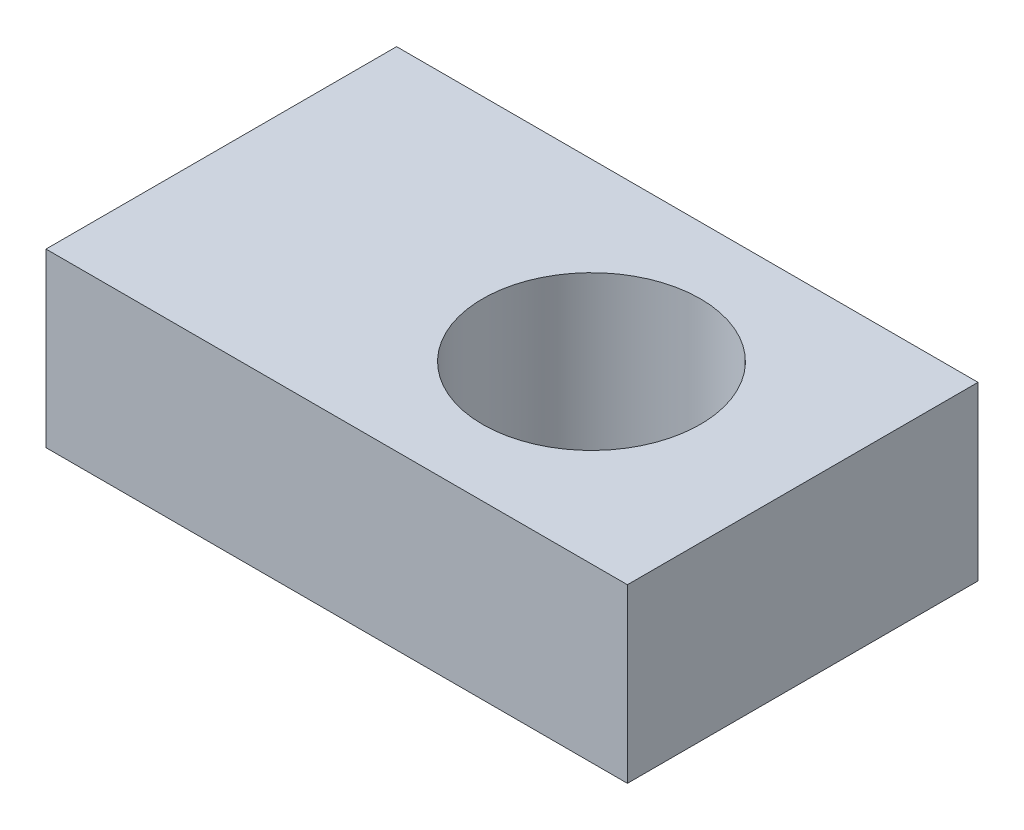
ISO-10303-21;
HEADER;
FILE_DESCRIPTION(('STEP AP214'),'2;1');
FILE_NAME('part.step','',(''),(''),'','','');
FILE_SCHEMA(('AUTOMOTIVE_DESIGN { 1 0 10303 214 1 1 1 1 }'));
ENDSEC;
DATA;
#1=APPLICATION_CONTEXT('core data for automotive mechanical design processes');
#2=APPLICATION_PROTOCOL_DEFINITION('international standard','automotive_design',2000,#1);
#3=PRODUCT_CONTEXT('',#1,'mechanical');
#4=PRODUCT('Part','Part','',(#3));
#5=PRODUCT_RELATED_PRODUCT_CATEGORY('part','',(#4));
#6=PRODUCT_DEFINITION_FORMATION('','',#4);
#7=PRODUCT_DEFINITION_CONTEXT('part definition',#1,'design');
#8=PRODUCT_DEFINITION('design','',#6,#7);
#9=PRODUCT_DEFINITION_SHAPE('','',#8);
#10=(LENGTH_UNIT() NAMED_UNIT(*) SI_UNIT(.MILLI.,.METRE.));
#11=(NAMED_UNIT(*) PLANE_ANGLE_UNIT() SI_UNIT($,.RADIAN.));
#12=(NAMED_UNIT(*) SI_UNIT($,.STERADIAN.) SOLID_ANGLE_UNIT());
#13=UNCERTAINTY_MEASURE_WITH_UNIT(LENGTH_MEASURE(1.E-05),#10,'distance_accuracy_value','');
#14=(GEOMETRIC_REPRESENTATION_CONTEXT(3) GLOBAL_UNCERTAINTY_ASSIGNED_CONTEXT((#13)) GLOBAL_UNIT_ASSIGNED_CONTEXT((#10,
#11,#12)) REPRESENTATION_CONTEXT('',''));
#15=CARTESIAN_POINT('',(0.,0.,0.));
#16=DIRECTION('',(0.,0.,1.));
#17=DIRECTION('',(1.,0.,0.));
#18=AXIS2_PLACEMENT_3D('',#15,#16,#17);
#19=CARTESIAN_POINT('',(2.77,-0.06,4.96));
#20=DIRECTION('',(0.,-1.,0.));
#21=DIRECTION('',(0.,0.,-1.));
#22=AXIS2_PLACEMENT_3D('',#19,#20,#21);
#23=PLANE('',#22);
#24=CARTESIAN_POINT('',(3.5,-0.0599999999999999,4.96));
#25=DIRECTION('',(0.,-1.,0.));
#26=DIRECTION('',(0.,0.,-1.));
#27=AXIS2_PLACEMENT_3D('',#24,#25,#26);
#28=CIRCLE('',#27,1.);
#29=CARTESIAN_POINT('',(3.5,-0.0599999999999999,3.96));
#30=VERTEX_POINT('',#29);
#31=EDGE_CURVE('E20',#30,#30,#28,.F.);
#32=ORIENTED_EDGE('',*,*,#31,.T.);
#33=EDGE_LOOP('',(#32));
#34=FACE_BOUND('',#33,.T.);
#35=DIRECTION('',(-1.,0.,0.));
#36=VECTOR('',#35,1.);
#37=CARTESIAN_POINT('',(0.1,-0.0599999999999999,3.35));
#38=LINE('',#37,#36);
#39=CARTESIAN_POINT('',(5.44,-0.06,3.35));
#40=VERTEX_POINT('',#39);
#41=CARTESIAN_POINT('',(0.1,-0.06,3.35));
#42=VERTEX_POINT('',#41);
#43=EDGE_CURVE('E69',#40,#42,#38,.T.);
#44=ORIENTED_EDGE('',*,*,#43,.F.);
#45=DIRECTION('',(0.,0.,-1.));
#46=VECTOR('',#45,1.);
#47=CARTESIAN_POINT('',(5.44,-0.0599999999999999,3.35));
#48=LINE('',#47,#46);
#49=CARTESIAN_POINT('',(5.44,-0.06,6.57));
#50=VERTEX_POINT('',#49);
#51=EDGE_CURVE('E54',#50,#40,#48,.T.);
#52=ORIENTED_EDGE('',*,*,#51,.F.);
#53=DIRECTION('',(1.,0.,0.));
#54=VECTOR('',#53,1.);
#55=CARTESIAN_POINT('',(5.44,-0.0599999999999999,6.57));
#56=LINE('',#55,#54);
#57=CARTESIAN_POINT('',(0.1,-0.06,6.57));
#58=VERTEX_POINT('',#57);
#59=EDGE_CURVE('E59',#58,#50,#56,.T.);
#60=ORIENTED_EDGE('',*,*,#59,.F.);
#61=DIRECTION('',(0.,0.,1.));
#62=VECTOR('',#61,1.);
#63=CARTESIAN_POINT('',(0.1,-0.0599999999999999,6.57));
#64=LINE('',#63,#62);
#65=EDGE_CURVE('E82',#42,#58,#64,.T.);
#66=ORIENTED_EDGE('',*,*,#65,.F.);
#67=EDGE_LOOP('',(#44,#52,#60,#66));
#68=FACE_BOUND('',#67,.T.);
#69=ADVANCED_FACE('F17',(#34,#68),#23,.T.);
#70=CARTESIAN_POINT('',(5.44,1.52,6.57));
#71=DIRECTION('',(0.,0.,1.));
#72=DIRECTION('',(1.,0.,0.));
#73=AXIS2_PLACEMENT_3D('',#70,#71,#72);
#74=PLANE('',#73);
#75=ORIENTED_EDGE('',*,*,#59,.T.);
#76=DIRECTION('',(0.,1.,0.));
#77=VECTOR('',#76,1.);
#78=CARTESIAN_POINT('',(5.44,1.52,6.57));
#79=LINE('',#78,#77);
#80=CARTESIAN_POINT('',(5.44,1.52,6.57));
#81=VERTEX_POINT('',#80);
#82=EDGE_CURVE('E61',#81,#50,#79,.F.);
#83=ORIENTED_EDGE('',*,*,#82,.F.);
#84=DIRECTION('',(1.,0.,0.));
#85=VECTOR('',#84,1.);
#86=CARTESIAN_POINT('',(2.77,1.52,6.57));
#87=LINE('',#86,#85);
#88=CARTESIAN_POINT('',(0.1,1.52,6.57));
#89=VERTEX_POINT('',#88);
#90=EDGE_CURVE('E85',#89,#81,#87,.T.);
#91=ORIENTED_EDGE('',*,*,#90,.F.);
#92=DIRECTION('',(0.,1.,0.));
#93=VECTOR('',#92,1.);
#94=CARTESIAN_POINT('',(0.1,1.52,6.57));
#95=LINE('',#94,#93);
#96=EDGE_CURVE('E64',#58,#89,#95,.T.);
#97=ORIENTED_EDGE('',*,*,#96,.F.);
#98=EDGE_LOOP('',(#75,#83,#91,#97));
#99=FACE_BOUND('',#98,.T.);
#100=ADVANCED_FACE('F60',(#99),#74,.T.);
#101=CARTESIAN_POINT('',(5.44,1.52,3.35));
#102=DIRECTION('',(1.,0.,0.));
#103=DIRECTION('',(0.,0.,-1.));
#104=AXIS2_PLACEMENT_3D('',#101,#102,#103);
#105=PLANE('',#104);
#106=ORIENTED_EDGE('',*,*,#51,.T.);
#107=DIRECTION('',(0.,1.,0.));
#108=VECTOR('',#107,1.);
#109=CARTESIAN_POINT('',(5.44,1.52,3.35));
#110=LINE('',#109,#108);
#111=CARTESIAN_POINT('',(5.44,1.52,3.35));
#112=VERTEX_POINT('',#111);
#113=EDGE_CURVE('E71',#112,#40,#110,.F.);
#114=ORIENTED_EDGE('',*,*,#113,.F.);
#115=DIRECTION('',(0.,0.,1.));
#116=VECTOR('',#115,1.);
#117=CARTESIAN_POINT('',(5.44,1.52,4.96));
#118=LINE('',#117,#116);
#119=EDGE_CURVE('E75',#81,#112,#118,.F.);
#120=ORIENTED_EDGE('',*,*,#119,.F.);
#121=ORIENTED_EDGE('',*,*,#82,.T.);
#122=EDGE_LOOP('',(#106,#114,#120,#121));
#123=FACE_BOUND('',#122,.T.);
#124=ADVANCED_FACE('F73',(#123),#105,.T.);
#125=CARTESIAN_POINT('',(0.1,1.52,3.35));
#126=DIRECTION('',(0.,0.,-1.));
#127=DIRECTION('',(-1.,0.,0.));
#128=AXIS2_PLACEMENT_3D('',#125,#126,#127);
#129=PLANE('',#128);
#130=ORIENTED_EDGE('',*,*,#43,.T.);
#131=DIRECTION('',(0.,1.,0.));
#132=VECTOR('',#131,1.);
#133=CARTESIAN_POINT('',(0.1,1.52,3.35));
#134=LINE('',#133,#132);
#135=CARTESIAN_POINT('',(0.1,1.52,3.35));
#136=VERTEX_POINT('',#135);
#137=EDGE_CURVE('E34',#136,#42,#134,.F.);
#138=ORIENTED_EDGE('',*,*,#137,.F.);
#139=DIRECTION('',(1.,0.,0.));
#140=VECTOR('',#139,1.);
#141=CARTESIAN_POINT('',(2.77,1.52,3.35));
#142=LINE('',#141,#140);
#143=EDGE_CURVE('E88',#112,#136,#142,.F.);
#144=ORIENTED_EDGE('',*,*,#143,.F.);
#145=ORIENTED_EDGE('',*,*,#113,.T.);
#146=EDGE_LOOP('',(#130,#138,#144,#145));
#147=FACE_BOUND('',#146,.T.);
#148=ADVANCED_FACE('F98',(#147),#129,.T.);
#149=CARTESIAN_POINT('',(0.1,1.52,6.57));
#150=DIRECTION('',(-1.,0.,0.));
#151=DIRECTION('',(0.,0.,1.));
#152=AXIS2_PLACEMENT_3D('',#149,#150,#151);
#153=PLANE('',#152);
#154=ORIENTED_EDGE('',*,*,#65,.T.);
#155=ORIENTED_EDGE('',*,*,#96,.T.);
#156=DIRECTION('',(0.,0.,1.));
#157=VECTOR('',#156,1.);
#158=CARTESIAN_POINT('',(0.0999999999999998,1.52,4.96));
#159=LINE('',#158,#157);
#160=EDGE_CURVE('E26',#136,#89,#159,.T.);
#161=ORIENTED_EDGE('',*,*,#160,.F.);
#162=ORIENTED_EDGE('',*,*,#137,.T.);
#163=EDGE_LOOP('',(#154,#155,#161,#162));
#164=FACE_BOUND('',#163,.T.);
#165=ADVANCED_FACE('F95',(#164),#153,.T.);
#166=CARTESIAN_POINT('',(3.5,1.52,4.96));
#167=DIRECTION('',(0.,-1.,0.));
#168=DIRECTION('',(0.,0.,-1.));
#169=AXIS2_PLACEMENT_3D('',#166,#167,#168);
#170=CYLINDRICAL_SURFACE('',#169,1.);
#171=ORIENTED_EDGE('',*,*,#31,.F.);
#172=EDGE_LOOP('',(#171));
#173=FACE_BOUND('',#172,.T.);
#174=CARTESIAN_POINT('',(3.5,1.52,4.96));
#175=DIRECTION('',(0.,-1.,0.));
#176=DIRECTION('',(0.,0.,-1.));
#177=AXIS2_PLACEMENT_3D('',#174,#175,#176);
#178=CIRCLE('',#177,1.);
#179=CARTESIAN_POINT('',(3.5,1.52,3.96));
#180=VERTEX_POINT('',#179);
#181=EDGE_CURVE('E11',#180,#180,#178,.T.);
#182=ORIENTED_EDGE('',*,*,#181,.F.);
#183=EDGE_LOOP('',(#182));
#184=FACE_BOUND('',#183,.T.);
#185=ADVANCED_FACE('F97',(#173,#184),#170,.F.);
#186=CARTESIAN_POINT('',(2.77,1.52,4.96));
#187=DIRECTION('',(0.,1.,0.));
#188=DIRECTION('',(0.,0.,1.));
#189=AXIS2_PLACEMENT_3D('',#186,#187,#188);
#190=PLANE('',#189);
#191=ORIENTED_EDGE('',*,*,#181,.T.);
#192=EDGE_LOOP('',(#191));
#193=FACE_BOUND('',#192,.T.);
#194=ORIENTED_EDGE('',*,*,#143,.T.);
#195=ORIENTED_EDGE('',*,*,#160,.T.);
#196=ORIENTED_EDGE('',*,*,#90,.T.);
#197=ORIENTED_EDGE('',*,*,#119,.T.);
#198=EDGE_LOOP('',(#194,#195,#196,#197));
#199=FACE_BOUND('',#198,.T.);
#200=ADVANCED_FACE('F93',(#193,#199),#190,.T.);
#201=CLOSED_SHELL('',(#69,#100,#124,#148,#165,#185,#200));
#202=MANIFOLD_SOLID_BREP('B1',#201);
#203=ADVANCED_BREP_SHAPE_REPRESENTATION('',(#18,#202),#14);
#204=SHAPE_DEFINITION_REPRESENTATION(#9,#203);
ENDSEC;
END-ISO-10303-21;
